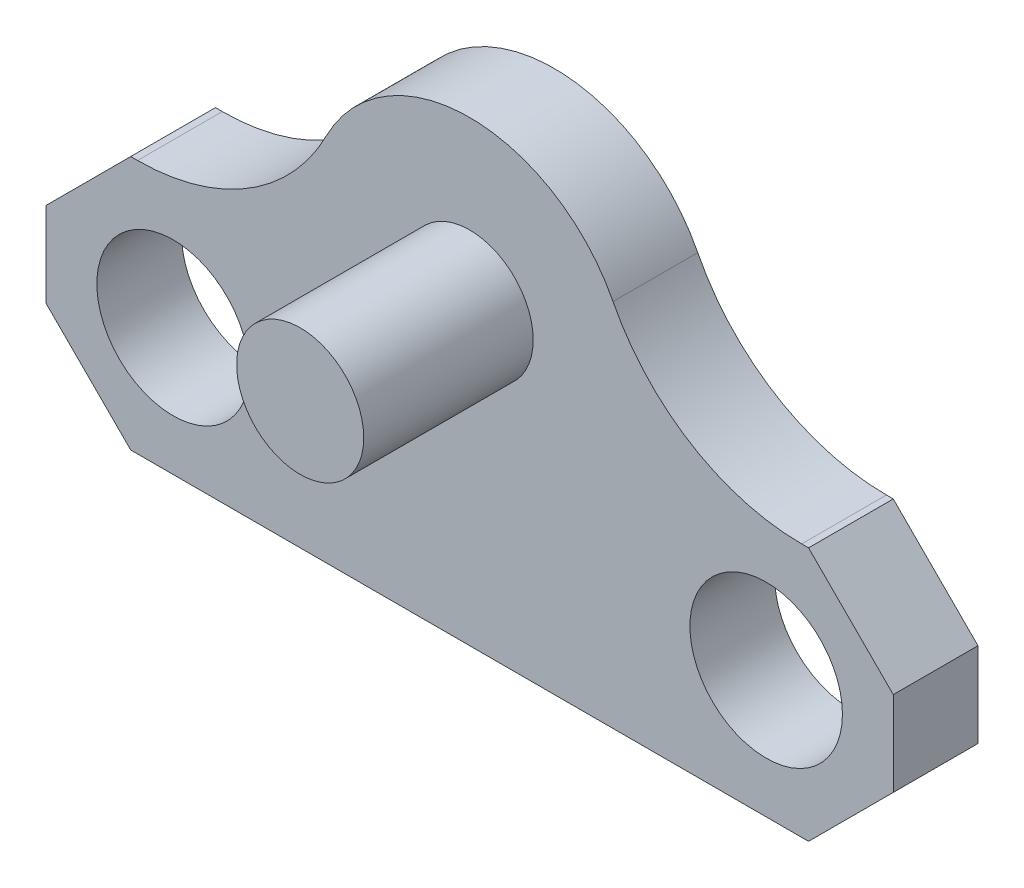
ISO-10303-21;
HEADER;
FILE_DESCRIPTION(('STEP AP214'),'2;1');
FILE_NAME('part.step','',(''),(''),'','','');
FILE_SCHEMA(('AUTOMOTIVE_DESIGN { 1 0 10303 214 1 1 1 1 }'));
ENDSEC;
DATA;
#1=APPLICATION_CONTEXT('core data for automotive mechanical design processes');
#2=APPLICATION_PROTOCOL_DEFINITION('international standard','automotive_design',2000,#1);
#3=PRODUCT_CONTEXT('',#1,'mechanical');
#4=PRODUCT('Part','Part','',(#3));
#5=PRODUCT_RELATED_PRODUCT_CATEGORY('part','',(#4));
#6=PRODUCT_DEFINITION_FORMATION('','',#4);
#7=PRODUCT_DEFINITION_CONTEXT('part definition',#1,'design');
#8=PRODUCT_DEFINITION('design','',#6,#7);
#9=PRODUCT_DEFINITION_SHAPE('','',#8);
#10=(LENGTH_UNIT() NAMED_UNIT(*) SI_UNIT(.MILLI.,.METRE.));
#11=(NAMED_UNIT(*) PLANE_ANGLE_UNIT() SI_UNIT($,.RADIAN.));
#12=(NAMED_UNIT(*) SI_UNIT($,.STERADIAN.) SOLID_ANGLE_UNIT());
#13=UNCERTAINTY_MEASURE_WITH_UNIT(LENGTH_MEASURE(1.E-05),#10,'distance_accuracy_value','');
#14=(GEOMETRIC_REPRESENTATION_CONTEXT(3) GLOBAL_UNCERTAINTY_ASSIGNED_CONTEXT((#13)) GLOBAL_UNIT_ASSIGNED_CONTEXT((#10,
#11,#12)) REPRESENTATION_CONTEXT('',''));
#15=CARTESIAN_POINT('',(0.,0.,0.));
#16=DIRECTION('',(0.,0.,1.));
#17=DIRECTION('',(1.,0.,0.));
#18=AXIS2_PLACEMENT_3D('',#15,#16,#17);
#19=CARTESIAN_POINT('',(2.74527368532916,13.97,2.54));
#20=DIRECTION('',(0.,0.,1.));
#21=DIRECTION('',(1.,0.,0.));
#22=AXIS2_PLACEMENT_3D('',#19,#20,#21);
#23=PLANE('',#22);
#24=CARTESIAN_POINT('',(12.7,8.89,2.54));
#25=DIRECTION('',(0.,0.,1.));
#26=DIRECTION('',(1.,0.,0.));
#27=AXIS2_PLACEMENT_3D('',#24,#25,#26);
#28=CIRCLE('',#27,1.905);
#29=CARTESIAN_POINT('',(14.605,8.89,2.54));
#30=VERTEX_POINT('',#29);
#31=EDGE_CURVE('E276',#30,#30,#28,.T.);
#32=ORIENTED_EDGE('',*,*,#31,.F.);
#33=EDGE_LOOP('',(#32));
#34=FACE_BOUND('',#33,.T.);
#35=CARTESIAN_POINT('',(3.81,3.81,2.54));
#36=DIRECTION('',(0.,0.,1.));
#37=DIRECTION('',(1.,0.,0.));
#38=AXIS2_PLACEMENT_3D('',#35,#36,#37);
#39=CIRCLE('',#38,2.286);
#40=CARTESIAN_POINT('',(6.096,3.81,2.54));
#41=VERTEX_POINT('',#40);
#42=EDGE_CURVE('E165',#41,#41,#39,.T.);
#43=ORIENTED_EDGE('',*,*,#42,.F.);
#44=EDGE_LOOP('',(#43));
#45=FACE_BOUND('',#44,.T.);
#46=DIRECTION('',(0.,-1.,0.));
#47=VECTOR('',#46,1.);
#48=CARTESIAN_POINT('',(0.,0.,2.54));
#49=LINE('',#48,#47);
#50=CARTESIAN_POINT('',(0.,5.08,2.54));
#51=VERTEX_POINT('',#50);
#52=CARTESIAN_POINT('',(0.,2.54000000000001,2.54));
#53=VERTEX_POINT('',#52);
#54=EDGE_CURVE('E180',#51,#53,#49,.T.);
#55=ORIENTED_EDGE('',*,*,#54,.T.);
#56=DIRECTION('',(-0.707106781186546,0.707106781186549,0.));
#57=VECTOR('',#56,1.);
#58=CARTESIAN_POINT('',(-4.34236315733542,6.88236315733545,2.54));
#59=LINE('',#58,#57);
#60=CARTESIAN_POINT('',(2.54,0.,2.54));
#61=VERTEX_POINT('',#60);
#62=EDGE_CURVE('E209',#53,#61,#59,.F.);
#63=ORIENTED_EDGE('',*,*,#62,.T.);
#64=DIRECTION('',(1.,0.,0.));
#65=VECTOR('',#64,1.);
#66=CARTESIAN_POINT('',(0.,0.,2.54));
#67=LINE('',#66,#65);
#68=CARTESIAN_POINT('',(22.86,0.,2.54));
#69=VERTEX_POINT('',#68);
#70=EDGE_CURVE('E292',#61,#69,#67,.T.);
#71=ORIENTED_EDGE('',*,*,#70,.T.);
#72=DIRECTION('',(-0.707106781186549,-0.707106781186546,0.));
#73=VECTOR('',#72,1.);
#74=CARTESIAN_POINT('',(19.7876368426645,-3.07236315733544,2.54));
#75=LINE('',#74,#73);
#76=CARTESIAN_POINT('',(25.4,2.54,2.54));
#77=VERTEX_POINT('',#76);
#78=EDGE_CURVE('E207',#69,#77,#75,.F.);
#79=ORIENTED_EDGE('',*,*,#78,.T.);
#80=DIRECTION('',(0.,1.,0.));
#81=VECTOR('',#80,1.);
#82=CARTESIAN_POINT('',(25.4,0.,2.54));
#83=LINE('',#82,#81);
#84=CARTESIAN_POINT('',(25.4,5.07999999999998,2.54));
#85=VERTEX_POINT('',#84);
#86=EDGE_CURVE('E136',#77,#85,#83,.T.);
#87=ORIENTED_EDGE('',*,*,#86,.T.);
#88=DIRECTION('',(0.707106781186546,-0.707106781186549,0.));
#89=VECTOR('',#88,1.);
#90=CARTESIAN_POINT('',(9.62763684266462,20.8523631573354,2.54));
#91=LINE('',#90,#89);
#92=CARTESIAN_POINT('',(22.86,7.62,2.54));
#93=VERTEX_POINT('',#92);
#94=EDGE_CURVE('E60',#85,#93,#91,.F.);
#95=ORIENTED_EDGE('',*,*,#94,.T.);
#96=DIRECTION('',(-1.,0.,0.));
#97=VECTOR('',#96,1.);
#98=CARTESIAN_POINT('',(22.6547263146708,7.62,2.54));
#99=LINE('',#98,#97);
#100=CARTESIAN_POINT('',(22.6547263146708,7.62,2.54));
#101=VERTEX_POINT('',#100);
#102=EDGE_CURVE('E126',#93,#101,#99,.T.);
#103=ORIENTED_EDGE('',*,*,#102,.T.);
#104=CARTESIAN_POINT('',(22.6547263146708,13.97,2.54));
#105=DIRECTION('',(0.,0.,-1.));
#106=DIRECTION('',(1.,0.,0.));
#107=AXIS2_PLACEMENT_3D('',#104,#105,#106);
#108=CIRCLE('',#107,6.35);
#109=CARTESIAN_POINT('',(16.9986318176988,11.0836363636364,2.54));
#110=VERTEX_POINT('',#109);
#111=EDGE_CURVE('E131',#101,#110,#108,.T.);
#112=ORIENTED_EDGE('',*,*,#111,.T.);
#113=CARTESIAN_POINT('',(12.7,8.89,2.54));
#114=DIRECTION('',(0.,0.,1.));
#115=DIRECTION('',(1.,0.,0.));
#116=AXIS2_PLACEMENT_3D('',#113,#114,#115);
#117=CIRCLE('',#116,4.826);
#118=CARTESIAN_POINT('',(8.40136818230123,11.0836363636364,2.54));
#119=VERTEX_POINT('',#118);
#120=EDGE_CURVE('E151',#110,#119,#117,.T.);
#121=ORIENTED_EDGE('',*,*,#120,.T.);
#122=CARTESIAN_POINT('',(2.74527368532916,13.97,2.54));
#123=DIRECTION('',(0.,0.,-1.));
#124=DIRECTION('',(1.,0.,0.));
#125=AXIS2_PLACEMENT_3D('',#122,#123,#124);
#126=CIRCLE('',#125,6.35);
#127=CARTESIAN_POINT('',(2.74527368532916,7.62,2.54));
#128=VERTEX_POINT('',#127);
#129=EDGE_CURVE('E153',#119,#128,#126,.T.);
#130=ORIENTED_EDGE('',*,*,#129,.T.);
#131=DIRECTION('',(-1.,0.,0.));
#132=VECTOR('',#131,1.);
#133=CARTESIAN_POINT('',(0.,7.62,2.54));
#134=LINE('',#133,#132);
#135=CARTESIAN_POINT('',(2.54000000000001,7.62,2.54));
#136=VERTEX_POINT('',#135);
#137=EDGE_CURVE('E158',#128,#136,#134,.T.);
#138=ORIENTED_EDGE('',*,*,#137,.T.);
#139=DIRECTION('',(0.707106781186549,0.707106781186546,0.));
#140=VECTOR('',#139,1.);
#141=CARTESIAN_POINT('',(5.81763684266459,10.8976368426646,2.54));
#142=LINE('',#141,#140);
#143=EDGE_CURVE('E204',#136,#51,#142,.F.);
#144=ORIENTED_EDGE('',*,*,#143,.T.);
#145=EDGE_LOOP('',(#55,#63,#71,#79,#87,#95,#103,#112,#121,#130,#138,#144));
#146=FACE_BOUND('',#145,.T.);
#147=CARTESIAN_POINT('',(21.59,3.81,2.54));
#148=DIRECTION('',(0.,0.,1.));
#149=DIRECTION('',(1.,0.,0.));
#150=AXIS2_PLACEMENT_3D('',#147,#148,#149);
#151=CIRCLE('',#150,2.28599999999999);
#152=CARTESIAN_POINT('',(23.876,3.81,2.54));
#153=VERTEX_POINT('',#152);
#154=EDGE_CURVE('E279',#153,#153,#151,.T.);
#155=ORIENTED_EDGE('',*,*,#154,.F.);
#156=EDGE_LOOP('',(#155));
#157=FACE_BOUND('',#156,.T.);
#158=ADVANCED_FACE('F38',(#34,#45,#146,#157),#23,.T.);
#159=CARTESIAN_POINT('',(2.74527368532916,13.97,0.));
#160=DIRECTION('',(0.,0.,1.));
#161=DIRECTION('',(1.,0.,0.));
#162=AXIS2_PLACEMENT_3D('',#159,#160,#161);
#163=PLANE('',#162);
#164=DIRECTION('',(1.,0.,0.));
#165=VECTOR('',#164,1.);
#166=CARTESIAN_POINT('',(0.,0.,0.));
#167=LINE('',#166,#165);
#168=CARTESIAN_POINT('',(2.54,0.,0.));
#169=VERTEX_POINT('',#168);
#170=CARTESIAN_POINT('',(22.86,0.,0.));
#171=VERTEX_POINT('',#170);
#172=EDGE_CURVE('E164',#169,#171,#167,.T.);
#173=ORIENTED_EDGE('',*,*,#172,.F.);
#174=DIRECTION('',(0.707106781186546,-0.707106781186549,0.));
#175=VECTOR('',#174,1.);
#176=CARTESIAN_POINT('',(2.54,0.,0.));
#177=LINE('',#176,#175);
#178=CARTESIAN_POINT('',(0.,2.54000000000001,0.));
#179=VERTEX_POINT('',#178);
#180=EDGE_CURVE('E197',#169,#179,#177,.F.);
#181=ORIENTED_EDGE('',*,*,#180,.T.);
#182=DIRECTION('',(0.,-1.,0.));
#183=VECTOR('',#182,1.);
#184=CARTESIAN_POINT('',(0.,0.,0.));
#185=LINE('',#184,#183);
#186=CARTESIAN_POINT('',(0.,5.08,0.));
#187=VERTEX_POINT('',#186);
#188=EDGE_CURVE('E161',#187,#179,#185,.T.);
#189=ORIENTED_EDGE('',*,*,#188,.F.);
#190=DIRECTION('',(-0.707106781186549,-0.707106781186546,0.));
#191=VECTOR('',#190,1.);
#192=CARTESIAN_POINT('',(0.,5.08,0.));
#193=LINE('',#192,#191);
#194=CARTESIAN_POINT('',(2.54000000000001,7.62,0.));
#195=VERTEX_POINT('',#194);
#196=EDGE_CURVE('E191',#187,#195,#193,.F.);
#197=ORIENTED_EDGE('',*,*,#196,.T.);
#198=DIRECTION('',(-1.,0.,0.));
#199=VECTOR('',#198,1.);
#200=CARTESIAN_POINT('',(0.,7.62,0.));
#201=LINE('',#200,#199);
#202=CARTESIAN_POINT('',(2.74527368532916,7.62,0.));
#203=VERTEX_POINT('',#202);
#204=EDGE_CURVE('E178',#203,#195,#201,.T.);
#205=ORIENTED_EDGE('',*,*,#204,.F.);
#206=CARTESIAN_POINT('',(2.74527368532916,13.97,0.));
#207=DIRECTION('',(0.,0.,-1.));
#208=DIRECTION('',(1.,0.,0.));
#209=AXIS2_PLACEMENT_3D('',#206,#207,#208);
#210=CIRCLE('',#209,6.35);
#211=CARTESIAN_POINT('',(8.40136818230123,11.0836363636364,0.));
#212=VERTEX_POINT('',#211);
#213=EDGE_CURVE('E176',#212,#203,#210,.T.);
#214=ORIENTED_EDGE('',*,*,#213,.F.);
#215=CARTESIAN_POINT('',(12.7,8.89,0.));
#216=DIRECTION('',(0.,0.,1.));
#217=DIRECTION('',(1.,0.,0.));
#218=AXIS2_PLACEMENT_3D('',#215,#216,#217);
#219=CIRCLE('',#218,4.826);
#220=CARTESIAN_POINT('',(16.9986318176988,11.0836363636364,0.));
#221=VERTEX_POINT('',#220);
#222=EDGE_CURVE('E174',#221,#212,#219,.T.);
#223=ORIENTED_EDGE('',*,*,#222,.F.);
#224=CARTESIAN_POINT('',(22.6547263146708,13.97,0.));
#225=DIRECTION('',(0.,0.,-1.));
#226=DIRECTION('',(1.,0.,0.));
#227=AXIS2_PLACEMENT_3D('',#224,#225,#226);
#228=CIRCLE('',#227,6.35);
#229=CARTESIAN_POINT('',(22.6547263146708,7.62,0.));
#230=VERTEX_POINT('',#229);
#231=EDGE_CURVE('E172',#230,#221,#228,.T.);
#232=ORIENTED_EDGE('',*,*,#231,.F.);
#233=DIRECTION('',(-1.,0.,0.));
#234=VECTOR('',#233,1.);
#235=CARTESIAN_POINT('',(22.6547263146708,7.62,0.));
#236=LINE('',#235,#234);
#237=CARTESIAN_POINT('',(22.86,7.62,0.));
#238=VERTEX_POINT('',#237);
#239=EDGE_CURVE('E142',#238,#230,#236,.T.);
#240=ORIENTED_EDGE('',*,*,#239,.F.);
#241=DIRECTION('',(-0.707106781186546,0.707106781186549,0.));
#242=VECTOR('',#241,1.);
#243=CARTESIAN_POINT('',(22.86,7.62,0.));
#244=LINE('',#243,#242);
#245=CARTESIAN_POINT('',(25.4,5.07999999999998,0.));
#246=VERTEX_POINT('',#245);
#247=EDGE_CURVE('E193',#238,#246,#244,.F.);
#248=ORIENTED_EDGE('',*,*,#247,.T.);
#249=DIRECTION('',(0.,1.,0.));
#250=VECTOR('',#249,1.);
#251=CARTESIAN_POINT('',(25.4,0.,0.));
#252=LINE('',#251,#250);
#253=CARTESIAN_POINT('',(25.4,2.54,0.));
#254=VERTEX_POINT('',#253);
#255=EDGE_CURVE('E168',#254,#246,#252,.T.);
#256=ORIENTED_EDGE('',*,*,#255,.F.);
#257=DIRECTION('',(0.707106781186549,0.707106781186546,0.));
#258=VECTOR('',#257,1.);
#259=CARTESIAN_POINT('',(25.4,2.54,0.));
#260=LINE('',#259,#258);
#261=EDGE_CURVE('E195',#254,#171,#260,.F.);
#262=ORIENTED_EDGE('',*,*,#261,.T.);
#263=EDGE_LOOP('',(#173,#181,#189,#197,#205,#214,#223,#232,#240,#248,#256,#262));
#264=FACE_BOUND('',#263,.T.);
#265=CARTESIAN_POINT('',(3.81,3.81,0.));
#266=DIRECTION('',(0.,0.,1.));
#267=DIRECTION('',(1.,0.,0.));
#268=AXIS2_PLACEMENT_3D('',#265,#266,#267);
#269=CIRCLE('',#268,2.286);
#270=CARTESIAN_POINT('',(6.096,3.81,0.));
#271=VERTEX_POINT('',#270);
#272=EDGE_CURVE('E285',#271,#271,#269,.T.);
#273=ORIENTED_EDGE('',*,*,#272,.T.);
#274=EDGE_LOOP('',(#273));
#275=FACE_BOUND('',#274,.T.);
#276=CARTESIAN_POINT('',(21.59,3.81,0.));
#277=DIRECTION('',(0.,0.,1.));
#278=DIRECTION('',(1.,0.,0.));
#279=AXIS2_PLACEMENT_3D('',#276,#277,#278);
#280=CIRCLE('',#279,2.28599999999999);
#281=CARTESIAN_POINT('',(23.876,3.81,0.));
#282=VERTEX_POINT('',#281);
#283=EDGE_CURVE('E275',#282,#282,#280,.T.);
#284=ORIENTED_EDGE('',*,*,#283,.T.);
#285=EDGE_LOOP('',(#284));
#286=FACE_BOUND('',#285,.T.);
#287=ADVANCED_FACE('F218',(#264,#275,#286),#163,.F.);
#288=CARTESIAN_POINT('',(0.,0.,2.54));
#289=DIRECTION('',(1.,0.,0.));
#290=DIRECTION('',(0.,0.,-1.));
#291=AXIS2_PLACEMENT_3D('',#288,#289,#290);
#292=PLANE('',#291);
#293=ORIENTED_EDGE('',*,*,#188,.T.);
#294=DIRECTION('',(0.,0.,1.));
#295=VECTOR('',#294,1.);
#296=CARTESIAN_POINT('',(0.,2.54000000000001,2.54));
#297=LINE('',#296,#295);
#298=EDGE_CURVE('E202',#179,#53,#297,.T.);
#299=ORIENTED_EDGE('',*,*,#298,.T.);
#300=ORIENTED_EDGE('',*,*,#54,.F.);
#301=DIRECTION('',(0.,0.,-1.));
#302=VECTOR('',#301,1.);
#303=CARTESIAN_POINT('',(0.,5.08,2.54));
#304=LINE('',#303,#302);
#305=EDGE_CURVE('E199',#51,#187,#304,.T.);
#306=ORIENTED_EDGE('',*,*,#305,.T.);
#307=EDGE_LOOP('',(#293,#299,#300,#306));
#308=FACE_BOUND('',#307,.T.);
#309=ADVANCED_FACE('F251',(#308),#292,.F.);
#310=CARTESIAN_POINT('',(0.,0.,2.54));
#311=DIRECTION('',(0.,1.,0.));
#312=DIRECTION('',(0.,0.,1.));
#313=AXIS2_PLACEMENT_3D('',#310,#311,#312);
#314=PLANE('',#313);
#315=ORIENTED_EDGE('',*,*,#70,.F.);
#316=DIRECTION('',(0.,0.,-1.));
#317=VECTOR('',#316,1.);
#318=CARTESIAN_POINT('',(2.54,0.,2.54));
#319=LINE('',#318,#317);
#320=EDGE_CURVE('E188',#61,#169,#319,.T.);
#321=ORIENTED_EDGE('',*,*,#320,.T.);
#322=ORIENTED_EDGE('',*,*,#172,.T.);
#323=DIRECTION('',(0.,0.,1.));
#324=VECTOR('',#323,1.);
#325=CARTESIAN_POINT('',(22.86,0.,2.54));
#326=LINE('',#325,#324);
#327=EDGE_CURVE('E145',#171,#69,#326,.T.);
#328=ORIENTED_EDGE('',*,*,#327,.T.);
#329=EDGE_LOOP('',(#315,#321,#322,#328));
#330=FACE_BOUND('',#329,.T.);
#331=ADVANCED_FACE('F305',(#330),#314,.F.);
#332=CARTESIAN_POINT('',(25.4,0.,2.54));
#333=DIRECTION('',(-1.,0.,0.));
#334=DIRECTION('',(0.,0.,1.));
#335=AXIS2_PLACEMENT_3D('',#332,#333,#334);
#336=PLANE('',#335);
#337=ORIENTED_EDGE('',*,*,#86,.F.);
#338=DIRECTION('',(0.,0.,-1.));
#339=VECTOR('',#338,1.);
#340=CARTESIAN_POINT('',(25.4,2.54,2.54));
#341=LINE('',#340,#339);
#342=EDGE_CURVE('E213',#77,#254,#341,.T.);
#343=ORIENTED_EDGE('',*,*,#342,.T.);
#344=ORIENTED_EDGE('',*,*,#255,.T.);
#345=DIRECTION('',(0.,0.,1.));
#346=VECTOR('',#345,1.);
#347=CARTESIAN_POINT('',(25.4,5.07999999999998,2.54));
#348=LINE('',#347,#346);
#349=EDGE_CURVE('E211',#246,#85,#348,.T.);
#350=ORIENTED_EDGE('',*,*,#349,.T.);
#351=EDGE_LOOP('',(#337,#343,#344,#350));
#352=FACE_BOUND('',#351,.T.);
#353=ADVANCED_FACE('F300',(#352),#336,.F.);
#354=CARTESIAN_POINT('',(22.6547263146708,7.62,2.54));
#355=DIRECTION('',(0.,-1.,0.));
#356=DIRECTION('',(0.,0.,-1.));
#357=AXIS2_PLACEMENT_3D('',#354,#355,#356);
#358=PLANE('',#357);
#359=ORIENTED_EDGE('',*,*,#102,.F.);
#360=DIRECTION('',(0.,0.,-1.));
#361=VECTOR('',#360,1.);
#362=CARTESIAN_POINT('',(22.86,7.62,2.54));
#363=LINE('',#362,#361);
#364=EDGE_CURVE('E47',#93,#238,#363,.T.);
#365=ORIENTED_EDGE('',*,*,#364,.T.);
#366=ORIENTED_EDGE('',*,*,#239,.T.);
#367=DIRECTION('',(0.,0.,-1.));
#368=VECTOR('',#367,1.);
#369=CARTESIAN_POINT('',(22.6547263146708,7.62,2.54));
#370=LINE('',#369,#368);
#371=EDGE_CURVE('E139',#101,#230,#370,.T.);
#372=ORIENTED_EDGE('',*,*,#371,.F.);
#373=EDGE_LOOP('',(#359,#365,#366,#372));
#374=FACE_BOUND('',#373,.T.);
#375=ADVANCED_FACE('F140',(#374),#358,.F.);
#376=CARTESIAN_POINT('',(22.6547263146708,13.97,2.54));
#377=DIRECTION('',(0.,0.,-1.));
#378=DIRECTION('',(-1.,0.,0.));
#379=AXIS2_PLACEMENT_3D('',#376,#377,#378);
#380=CYLINDRICAL_SURFACE('',#379,6.35);
#381=ORIENTED_EDGE('',*,*,#231,.T.);
#382=DIRECTION('',(0.,0.,-1.));
#383=VECTOR('',#382,1.);
#384=CARTESIAN_POINT('',(16.9986318176988,11.0836363636364,2.54));
#385=LINE('',#384,#383);
#386=EDGE_CURVE('E146',#110,#221,#385,.T.);
#387=ORIENTED_EDGE('',*,*,#386,.F.);
#388=ORIENTED_EDGE('',*,*,#111,.F.);
#389=ORIENTED_EDGE('',*,*,#371,.T.);
#390=EDGE_LOOP('',(#381,#387,#388,#389));
#391=FACE_BOUND('',#390,.T.);
#392=ADVANCED_FACE('F148',(#391),#380,.F.);
#393=CARTESIAN_POINT('',(12.7,8.89,2.54));
#394=DIRECTION('',(0.,0.,-1.));
#395=DIRECTION('',(-1.,0.,0.));
#396=AXIS2_PLACEMENT_3D('',#393,#394,#395);
#397=CYLINDRICAL_SURFACE('',#396,4.826);
#398=ORIENTED_EDGE('',*,*,#222,.T.);
#399=DIRECTION('',(0.,0.,-1.));
#400=VECTOR('',#399,1.);
#401=CARTESIAN_POINT('',(8.40136818230123,11.0836363636364,2.54));
#402=LINE('',#401,#400);
#403=EDGE_CURVE('E183',#119,#212,#402,.T.);
#404=ORIENTED_EDGE('',*,*,#403,.F.);
#405=ORIENTED_EDGE('',*,*,#120,.F.);
#406=ORIENTED_EDGE('',*,*,#386,.T.);
#407=EDGE_LOOP('',(#398,#404,#405,#406));
#408=FACE_BOUND('',#407,.T.);
#409=ADVANCED_FACE('F224',(#408),#397,.T.);
#410=CARTESIAN_POINT('',(2.74527368532916,13.97,2.54));
#411=DIRECTION('',(0.,0.,-1.));
#412=DIRECTION('',(-1.,0.,0.));
#413=AXIS2_PLACEMENT_3D('',#410,#411,#412);
#414=CYLINDRICAL_SURFACE('',#413,6.35);
#415=ORIENTED_EDGE('',*,*,#213,.T.);
#416=DIRECTION('',(0.,0.,-1.));
#417=VECTOR('',#416,1.);
#418=CARTESIAN_POINT('',(2.74527368532916,7.62,2.54));
#419=LINE('',#418,#417);
#420=EDGE_CURVE('E160',#128,#203,#419,.T.);
#421=ORIENTED_EDGE('',*,*,#420,.F.);
#422=ORIENTED_EDGE('',*,*,#129,.F.);
#423=ORIENTED_EDGE('',*,*,#403,.T.);
#424=EDGE_LOOP('',(#415,#421,#422,#423));
#425=FACE_BOUND('',#424,.T.);
#426=ADVANCED_FACE('F230',(#425),#414,.F.);
#427=CARTESIAN_POINT('',(0.,7.62,2.54));
#428=DIRECTION('',(0.,-1.,0.));
#429=DIRECTION('',(0.,0.,-1.));
#430=AXIS2_PLACEMENT_3D('',#427,#428,#429);
#431=PLANE('',#430);
#432=ORIENTED_EDGE('',*,*,#204,.T.);
#433=DIRECTION('',(0.,0.,1.));
#434=VECTOR('',#433,1.);
#435=CARTESIAN_POINT('',(2.54000000000001,7.62,2.54));
#436=LINE('',#435,#434);
#437=EDGE_CURVE('E11',#195,#136,#436,.T.);
#438=ORIENTED_EDGE('',*,*,#437,.T.);
#439=ORIENTED_EDGE('',*,*,#137,.F.);
#440=ORIENTED_EDGE('',*,*,#420,.T.);
#441=EDGE_LOOP('',(#432,#438,#439,#440));
#442=FACE_BOUND('',#441,.T.);
#443=ADVANCED_FACE('F232',(#442),#431,.F.);
#444=CARTESIAN_POINT('',(3.81,3.81,2.54));
#445=DIRECTION('',(0.,0.,-1.));
#446=DIRECTION('',(-1.,0.,0.));
#447=AXIS2_PLACEMENT_3D('',#444,#445,#446);
#448=CYLINDRICAL_SURFACE('',#447,2.286);
#449=ORIENTED_EDGE('',*,*,#42,.T.);
#450=EDGE_LOOP('',(#449));
#451=FACE_BOUND('',#450,.T.);
#452=ORIENTED_EDGE('',*,*,#272,.F.);
#453=EDGE_LOOP('',(#452));
#454=FACE_BOUND('',#453,.T.);
#455=ADVANCED_FACE('F234',(#451,#454),#448,.F.);
#456=CARTESIAN_POINT('',(21.59,3.81,2.54));
#457=DIRECTION('',(0.,0.,-1.));
#458=DIRECTION('',(-1.,0.,0.));
#459=AXIS2_PLACEMENT_3D('',#456,#457,#458);
#460=CYLINDRICAL_SURFACE('',#459,2.28599999999999);
#461=ORIENTED_EDGE('',*,*,#154,.T.);
#462=EDGE_LOOP('',(#461));
#463=FACE_BOUND('',#462,.T.);
#464=ORIENTED_EDGE('',*,*,#283,.F.);
#465=EDGE_LOOP('',(#464));
#466=FACE_BOUND('',#465,.T.);
#467=ADVANCED_FACE('F240',(#463,#466),#460,.F.);
#468=CARTESIAN_POINT('',(12.7,8.89,7.62));
#469=DIRECTION('',(0.,0.,-1.));
#470=DIRECTION('',(-1.,0.,0.));
#471=AXIS2_PLACEMENT_3D('',#468,#469,#470);
#472=CYLINDRICAL_SURFACE('',#471,1.905);
#473=CARTESIAN_POINT('',(12.7,8.89,7.62));
#474=DIRECTION('',(0.,0.,1.));
#475=DIRECTION('',(1.,0.,0.));
#476=AXIS2_PLACEMENT_3D('',#473,#474,#475);
#477=CIRCLE('',#476,1.905);
#478=CARTESIAN_POINT('',(14.605,8.89,7.62));
#479=VERTEX_POINT('',#478);
#480=EDGE_CURVE('E274',#479,#479,#477,.T.);
#481=ORIENTED_EDGE('',*,*,#480,.F.);
#482=EDGE_LOOP('',(#481));
#483=FACE_BOUND('',#482,.T.);
#484=ORIENTED_EDGE('',*,*,#31,.T.);
#485=EDGE_LOOP('',(#484));
#486=FACE_BOUND('',#485,.T.);
#487=ADVANCED_FACE('F257',(#483,#486),#472,.T.);
#488=CARTESIAN_POINT('',(12.7,8.89,7.62));
#489=DIRECTION('',(0.,0.,1.));
#490=DIRECTION('',(1.,0.,0.));
#491=AXIS2_PLACEMENT_3D('',#488,#489,#490);
#492=PLANE('',#491);
#493=ORIENTED_EDGE('',*,*,#480,.T.);
#494=EDGE_LOOP('',(#493));
#495=FACE_BOUND('',#494,.T.);
#496=ADVANCED_FACE('F261',(#495),#492,.T.);
#497=CARTESIAN_POINT('',(2.54,0.,2.54));
#498=DIRECTION('',(0.707106781186549,0.707106781186546,0.));
#499=DIRECTION('',(0.,0.,-1.));
#500=AXIS2_PLACEMENT_3D('',#497,#498,#499);
#501=PLANE('',#500);
#502=ORIENTED_EDGE('',*,*,#62,.F.);
#503=ORIENTED_EDGE('',*,*,#298,.F.);
#504=ORIENTED_EDGE('',*,*,#180,.F.);
#505=ORIENTED_EDGE('',*,*,#320,.F.);
#506=EDGE_LOOP('',(#502,#503,#504,#505));
#507=FACE_BOUND('',#506,.T.);
#508=ADVANCED_FACE('F264',(#507),#501,.F.);
#509=CARTESIAN_POINT('',(25.4,2.54,2.54));
#510=DIRECTION('',(-0.707106781186546,0.707106781186549,0.));
#511=DIRECTION('',(0.,0.,-1.));
#512=AXIS2_PLACEMENT_3D('',#509,#510,#511);
#513=PLANE('',#512);
#514=ORIENTED_EDGE('',*,*,#78,.F.);
#515=ORIENTED_EDGE('',*,*,#327,.F.);
#516=ORIENTED_EDGE('',*,*,#261,.F.);
#517=ORIENTED_EDGE('',*,*,#342,.F.);
#518=EDGE_LOOP('',(#514,#515,#516,#517));
#519=FACE_BOUND('',#518,.T.);
#520=ADVANCED_FACE('F269',(#519),#513,.F.);
#521=CARTESIAN_POINT('',(22.86,7.62,2.54));
#522=DIRECTION('',(-0.707106781186549,-0.707106781186546,0.));
#523=DIRECTION('',(0.,0.,-1.));
#524=AXIS2_PLACEMENT_3D('',#521,#522,#523);
#525=PLANE('',#524);
#526=ORIENTED_EDGE('',*,*,#94,.F.);
#527=ORIENTED_EDGE('',*,*,#349,.F.);
#528=ORIENTED_EDGE('',*,*,#247,.F.);
#529=ORIENTED_EDGE('',*,*,#364,.F.);
#530=EDGE_LOOP('',(#526,#527,#528,#529));
#531=FACE_BOUND('',#530,.T.);
#532=ADVANCED_FACE('F299',(#531),#525,.F.);
#533=CARTESIAN_POINT('',(0.,5.08,2.54));
#534=DIRECTION('',(0.707106781186546,-0.707106781186549,0.));
#535=DIRECTION('',(0.,0.,-1.));
#536=AXIS2_PLACEMENT_3D('',#533,#534,#535);
#537=PLANE('',#536);
#538=ORIENTED_EDGE('',*,*,#143,.F.);
#539=ORIENTED_EDGE('',*,*,#437,.F.);
#540=ORIENTED_EDGE('',*,*,#196,.F.);
#541=ORIENTED_EDGE('',*,*,#305,.F.);
#542=EDGE_LOOP('',(#538,#539,#540,#541));
#543=FACE_BOUND('',#542,.T.);
#544=ADVANCED_FACE('F41',(#543),#537,.F.);
#545=CLOSED_SHELL('',(#158,#287,#309,#331,#353,#375,#392,#409,#426,#443,#455,#467,#487,#496,
#508,#520,#532,#544));
#546=MANIFOLD_SOLID_BREP('B2',#545);
#547=ADVANCED_BREP_SHAPE_REPRESENTATION('',(#18,#546),#14);
#548=SHAPE_DEFINITION_REPRESENTATION(#9,#547);
ENDSEC;
END-ISO-10303-21;
